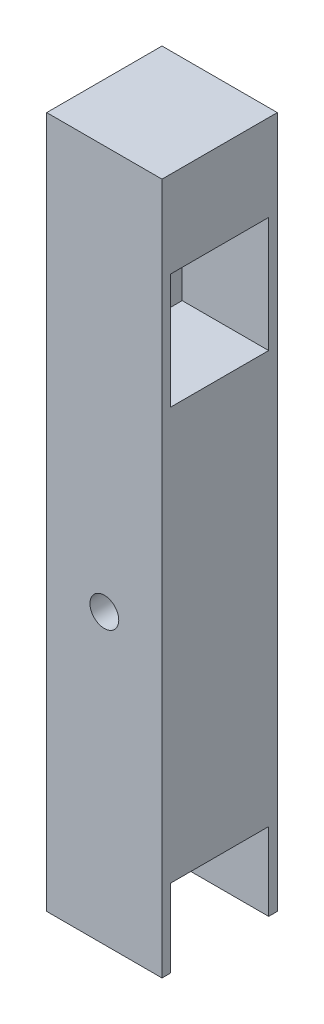
ISO-10303-21;
HEADER;
FILE_DESCRIPTION(('STEP AP214'),'2;1');
FILE_NAME('part.step','',(''),(''),'','','');
FILE_SCHEMA(('AUTOMOTIVE_DESIGN { 1 0 10303 214 1 1 1 1 }'));
ENDSEC;
DATA;
#1=APPLICATION_CONTEXT('core data for automotive mechanical design processes');
#2=APPLICATION_PROTOCOL_DEFINITION('international standard','automotive_design',2000,#1);
#3=PRODUCT_CONTEXT('',#1,'mechanical');
#4=PRODUCT('Part','Part','',(#3));
#5=PRODUCT_RELATED_PRODUCT_CATEGORY('part','',(#4));
#6=PRODUCT_DEFINITION_FORMATION('','',#4);
#7=PRODUCT_DEFINITION_CONTEXT('part definition',#1,'design');
#8=PRODUCT_DEFINITION('design','',#6,#7);
#9=PRODUCT_DEFINITION_SHAPE('','',#8);
#10=(LENGTH_UNIT() NAMED_UNIT(*) SI_UNIT(.MILLI.,.METRE.));
#11=(NAMED_UNIT(*) PLANE_ANGLE_UNIT() SI_UNIT($,.RADIAN.));
#12=(NAMED_UNIT(*) SI_UNIT($,.STERADIAN.) SOLID_ANGLE_UNIT());
#13=UNCERTAINTY_MEASURE_WITH_UNIT(LENGTH_MEASURE(1.E-05),#10,'distance_accuracy_value','');
#14=(GEOMETRIC_REPRESENTATION_CONTEXT(3) GLOBAL_UNCERTAINTY_ASSIGNED_CONTEXT((#13)) GLOBAL_UNIT_ASSIGNED_CONTEXT((#10,
#11,#12)) REPRESENTATION_CONTEXT('',''));
#15=CARTESIAN_POINT('',(0.,0.,0.));
#16=DIRECTION('',(0.,0.,1.));
#17=DIRECTION('',(1.,0.,0.));
#18=AXIS2_PLACEMENT_3D('',#15,#16,#17);
#19=CARTESIAN_POINT('',(25.4,0.,25.4));
#20=DIRECTION('',(-1.,0.,0.));
#21=DIRECTION('',(0.,-1.,0.));
#22=AXIS2_PLACEMENT_3D('',#19,#20,#21);
#23=PLANE('',#22);
#24=DIRECTION('',(0.,0.,-1.));
#25=VECTOR('',#24,1.);
#26=CARTESIAN_POINT('',(25.4,17.14754,23.495));
#27=LINE('',#26,#25);
#28=CARTESIAN_POINT('',(25.4,17.14754,23.495));
#29=VERTEX_POINT('',#28);
#30=CARTESIAN_POINT('',(25.4,17.14754,1.90499999999998));
#31=VERTEX_POINT('',#30);
#32=EDGE_CURVE('E60',#29,#31,#27,.T.);
#33=ORIENTED_EDGE('',*,*,#32,.T.);
#34=DIRECTION('',(0.,1.,0.));
#35=VECTOR('',#34,1.);
#36=CARTESIAN_POINT('',(25.4,-4.44245999999999,1.90499999999998));
#37=LINE('',#36,#35);
#38=CARTESIAN_POINT('',(25.4,0.,1.90499999999998));
#39=VERTEX_POINT('',#38);
#40=EDGE_CURVE('E175',#39,#31,#37,.T.);
#41=ORIENTED_EDGE('',*,*,#40,.F.);
#42=DIRECTION('',(0.,0.,-1.));
#43=VECTOR('',#42,1.);
#44=CARTESIAN_POINT('',(25.4,0.,25.4));
#45=LINE('',#44,#43);
#46=CARTESIAN_POINT('',(25.4,0.,0.));
#47=VERTEX_POINT('',#46);
#48=EDGE_CURVE('E229',#39,#47,#45,.T.);
#49=ORIENTED_EDGE('',*,*,#48,.T.);
#50=DIRECTION('',(0.,1.,0.));
#51=VECTOR('',#50,1.);
#52=CARTESIAN_POINT('',(25.4,0.,0.));
#53=LINE('',#52,#51);
#54=CARTESIAN_POINT('',(25.4,152.4,0.));
#55=VERTEX_POINT('',#54);
#56=EDGE_CURVE('E218',#47,#55,#53,.T.);
#57=ORIENTED_EDGE('',*,*,#56,.T.);
#58=DIRECTION('',(0.,0.,-1.));
#59=VECTOR('',#58,1.);
#60=CARTESIAN_POINT('',(25.4,152.4,25.4));
#61=LINE('',#60,#59);
#62=CARTESIAN_POINT('',(25.4,152.4,25.4));
#63=VERTEX_POINT('',#62);
#64=EDGE_CURVE('E227',#63,#55,#61,.T.);
#65=ORIENTED_EDGE('',*,*,#64,.F.);
#66=DIRECTION('',(0.,1.,0.));
#67=VECTOR('',#66,1.);
#68=CARTESIAN_POINT('',(25.4,0.,25.4));
#69=LINE('',#68,#67);
#70=CARTESIAN_POINT('',(25.4,0.,25.4));
#71=VERTEX_POINT('',#70);
#72=EDGE_CURVE('E204',#71,#63,#69,.T.);
#73=ORIENTED_EDGE('',*,*,#72,.F.);
#74=CARTESIAN_POINT('',(25.4,0.,23.495));
#75=VERTEX_POINT('',#74);
#76=EDGE_CURVE('E44',#71,#75,#45,.T.);
#77=ORIENTED_EDGE('',*,*,#76,.T.);
#78=DIRECTION('',(0.,1.,0.));
#79=VECTOR('',#78,1.);
#80=CARTESIAN_POINT('',(25.4,-4.44245999999999,23.495));
#81=LINE('',#80,#79);
#82=EDGE_CURVE('E172',#75,#29,#81,.T.);
#83=ORIENTED_EDGE('',*,*,#82,.T.);
#84=EDGE_LOOP('',(#33,#41,#49,#57,#65,#73,#77,#83));
#85=FACE_BOUND('',#84,.T.);
#86=DIRECTION('',(0.,0.,-1.));
#87=VECTOR('',#86,1.);
#88=CARTESIAN_POINT('',(25.4,133.35254,23.495));
#89=LINE('',#88,#87);
#90=CARTESIAN_POINT('',(25.4,133.35254,23.495));
#91=VERTEX_POINT('',#90);
#92=CARTESIAN_POINT('',(25.4,133.35254,1.90499999999999));
#93=VERTEX_POINT('',#92);
#94=EDGE_CURVE('E52',#91,#93,#89,.T.);
#95=ORIENTED_EDGE('',*,*,#94,.T.);
#96=DIRECTION('',(0.,1.,0.));
#97=VECTOR('',#96,1.);
#98=CARTESIAN_POINT('',(25.4,107.95254,1.90499999999999));
#99=LINE('',#98,#97);
#100=CARTESIAN_POINT('',(25.4,107.95254,1.90499999999999));
#101=VERTEX_POINT('',#100);
#102=EDGE_CURVE('E143',#101,#93,#99,.T.);
#103=ORIENTED_EDGE('',*,*,#102,.F.);
#104=DIRECTION('',(0.,0.,-1.));
#105=VECTOR('',#104,1.);
#106=CARTESIAN_POINT('',(25.4,107.95254,23.495));
#107=LINE('',#106,#105);
#108=CARTESIAN_POINT('',(25.4,107.95254,23.495));
#109=VERTEX_POINT('',#108);
#110=EDGE_CURVE('E158',#109,#101,#107,.T.);
#111=ORIENTED_EDGE('',*,*,#110,.F.);
#112=DIRECTION('',(0.,1.,0.));
#113=VECTOR('',#112,1.);
#114=CARTESIAN_POINT('',(25.4,107.95254,23.495));
#115=LINE('',#114,#113);
#116=EDGE_CURVE('E136',#109,#91,#115,.T.);
#117=ORIENTED_EDGE('',*,*,#116,.T.);
#118=EDGE_LOOP('',(#95,#103,#111,#117));
#119=FACE_BOUND('',#118,.T.);
#120=ADVANCED_FACE('F35',(#85,#119),#23,.F.);
#121=CARTESIAN_POINT('',(0.,6.35254,12.7));
#122=DIRECTION('',(1.,0.,0.));
#123=DIRECTION('',(0.,1.,0.));
#124=AXIS2_PLACEMENT_3D('',#121,#122,#123);
#125=CYLINDRICAL_SURFACE('',#124,6.34999999999999);
#126=CARTESIAN_POINT('',(0.,6.35254,12.7));
#127=DIRECTION('',(1.,0.,0.));
#128=DIRECTION('',(0.,1.,0.));
#129=AXIS2_PLACEMENT_3D('',#126,#127,#128);
#130=CIRCLE('',#129,6.34999999999999);
#131=CARTESIAN_POINT('',(0.,12.70254,12.7));
#132=VERTEX_POINT('',#131);
#133=EDGE_CURVE('E191',#132,#132,#130,.T.);
#134=ORIENTED_EDGE('',*,*,#133,.F.);
#135=EDGE_LOOP('',(#134));
#136=FACE_BOUND('',#135,.T.);
#137=CARTESIAN_POINT('',(6.35,6.35254,12.7));
#138=DIRECTION('',(1.,0.,0.));
#139=DIRECTION('',(0.,1.,0.));
#140=AXIS2_PLACEMENT_3D('',#137,#138,#139);
#141=CIRCLE('',#140,6.34999999999999);
#142=CARTESIAN_POINT('',(6.35,12.70254,12.7));
#143=VERTEX_POINT('',#142);
#144=EDGE_CURVE('E39',#143,#143,#141,.F.);
#145=ORIENTED_EDGE('',*,*,#144,.F.);
#146=EDGE_LOOP('',(#145));
#147=FACE_BOUND('',#146,.T.);
#148=ADVANCED_FACE('F239',(#136,#147),#125,.F.);
#149=CARTESIAN_POINT('',(0.,120.65254,12.7));
#150=DIRECTION('',(1.,0.,0.));
#151=DIRECTION('',(0.,1.,0.));
#152=AXIS2_PLACEMENT_3D('',#149,#150,#151);
#153=CYLINDRICAL_SURFACE('',#152,6.34999999999999);
#154=CARTESIAN_POINT('',(0.,120.65254,12.7));
#155=DIRECTION('',(1.,0.,0.));
#156=DIRECTION('',(0.,1.,0.));
#157=AXIS2_PLACEMENT_3D('',#154,#155,#156);
#158=CIRCLE('',#157,6.34999999999999);
#159=CARTESIAN_POINT('',(0.,127.00254,12.7));
#160=VERTEX_POINT('',#159);
#161=EDGE_CURVE('E192',#160,#160,#158,.T.);
#162=ORIENTED_EDGE('',*,*,#161,.F.);
#163=EDGE_LOOP('',(#162));
#164=FACE_BOUND('',#163,.T.);
#165=CARTESIAN_POINT('',(6.34999999999998,120.65254,12.7));
#166=DIRECTION('',(1.,0.,0.));
#167=DIRECTION('',(0.,1.,0.));
#168=AXIS2_PLACEMENT_3D('',#165,#166,#167);
#169=CIRCLE('',#168,6.34999999999999);
#170=CARTESIAN_POINT('',(6.34999999999998,127.00254,12.7));
#171=VERTEX_POINT('',#170);
#172=EDGE_CURVE('E144',#171,#171,#169,.F.);
#173=ORIENTED_EDGE('',*,*,#172,.F.);
#174=EDGE_LOOP('',(#173));
#175=FACE_BOUND('',#174,.T.);
#176=ADVANCED_FACE('F241',(#164,#175),#153,.F.);
#177=CARTESIAN_POINT('',(0.,0.,25.4));
#178=DIRECTION('',(-1.,0.,0.));
#179=DIRECTION('',(0.,0.,1.));
#180=AXIS2_PLACEMENT_3D('',#177,#178,#179);
#181=PLANE('',#180);
#182=ORIENTED_EDGE('',*,*,#161,.T.);
#183=EDGE_LOOP('',(#182));
#184=FACE_BOUND('',#183,.T.);
#185=ORIENTED_EDGE('',*,*,#133,.T.);
#186=EDGE_LOOP('',(#185));
#187=FACE_BOUND('',#186,.T.);
#188=DIRECTION('',(0.,1.,0.));
#189=VECTOR('',#188,1.);
#190=CARTESIAN_POINT('',(0.,0.,0.));
#191=LINE('',#190,#189);
#192=CARTESIAN_POINT('',(0.,0.,0.));
#193=VERTEX_POINT('',#192);
#194=CARTESIAN_POINT('',(0.,152.4,0.));
#195=VERTEX_POINT('',#194);
#196=EDGE_CURVE('E195',#193,#195,#191,.T.);
#197=ORIENTED_EDGE('',*,*,#196,.F.);
#198=DIRECTION('',(0.,0.,-1.));
#199=VECTOR('',#198,1.);
#200=CARTESIAN_POINT('',(0.,0.,25.4));
#201=LINE('',#200,#199);
#202=CARTESIAN_POINT('',(0.,0.,25.4));
#203=VERTEX_POINT('',#202);
#204=EDGE_CURVE('E11',#203,#193,#201,.T.);
#205=ORIENTED_EDGE('',*,*,#204,.F.);
#206=DIRECTION('',(0.,1.,0.));
#207=VECTOR('',#206,1.);
#208=CARTESIAN_POINT('',(0.,0.,25.4));
#209=LINE('',#208,#207);
#210=CARTESIAN_POINT('',(0.,152.4,25.4));
#211=VERTEX_POINT('',#210);
#212=EDGE_CURVE('E198',#203,#211,#209,.T.);
#213=ORIENTED_EDGE('',*,*,#212,.T.);
#214=DIRECTION('',(0.,0.,-1.));
#215=VECTOR('',#214,1.);
#216=CARTESIAN_POINT('',(0.,152.4,25.4));
#217=LINE('',#216,#215);
#218=EDGE_CURVE('E212',#211,#195,#217,.T.);
#219=ORIENTED_EDGE('',*,*,#218,.T.);
#220=EDGE_LOOP('',(#197,#205,#213,#219));
#221=FACE_BOUND('',#220,.T.);
#222=ADVANCED_FACE('F37',(#184,#187,#221),#181,.T.);
#223=CARTESIAN_POINT('',(0.,0.,25.4));
#224=DIRECTION('',(0.,1.,0.));
#225=DIRECTION('',(0.,0.,1.));
#226=AXIS2_PLACEMENT_3D('',#223,#224,#225);
#227=PLANE('',#226);
#228=ORIENTED_EDGE('',*,*,#48,.F.);
#229=DIRECTION('',(-1.,0.,0.));
#230=VECTOR('',#229,1.);
#231=CARTESIAN_POINT('',(0.,0.,1.90499999999998));
#232=LINE('',#231,#230);
#233=CARTESIAN_POINT('',(6.35,0.,1.90499999999998));
#234=VERTEX_POINT('',#233);
#235=EDGE_CURVE('E188',#39,#234,#232,.T.);
#236=ORIENTED_EDGE('',*,*,#235,.T.);
#237=DIRECTION('',(0.,0.,-1.));
#238=VECTOR('',#237,1.);
#239=CARTESIAN_POINT('',(6.35,0.,25.4));
#240=LINE('',#239,#238);
#241=CARTESIAN_POINT('',(6.35,0.,23.495));
#242=VERTEX_POINT('',#241);
#243=EDGE_CURVE('E184',#242,#234,#240,.T.);
#244=ORIENTED_EDGE('',*,*,#243,.F.);
#245=DIRECTION('',(-1.,0.,0.));
#246=VECTOR('',#245,1.);
#247=CARTESIAN_POINT('',(0.,0.,23.495));
#248=LINE('',#247,#246);
#249=EDGE_CURVE('E186',#75,#242,#248,.T.);
#250=ORIENTED_EDGE('',*,*,#249,.F.);
#251=ORIENTED_EDGE('',*,*,#76,.F.);
#252=DIRECTION('',(1.,0.,0.));
#253=VECTOR('',#252,1.);
#254=CARTESIAN_POINT('',(0.,0.,25.4));
#255=LINE('',#254,#253);
#256=EDGE_CURVE('E201',#203,#71,#255,.T.);
#257=ORIENTED_EDGE('',*,*,#256,.F.);
#258=ORIENTED_EDGE('',*,*,#204,.T.);
#259=DIRECTION('',(1.,0.,0.));
#260=VECTOR('',#259,1.);
#261=CARTESIAN_POINT('',(0.,0.,0.));
#262=LINE('',#261,#260);
#263=EDGE_CURVE('E215',#193,#47,#262,.T.);
#264=ORIENTED_EDGE('',*,*,#263,.T.);
#265=EDGE_LOOP('',(#228,#236,#244,#250,#251,#257,#258,#264));
#266=FACE_BOUND('',#265,.T.);
#267=ADVANCED_FACE('F269',(#266),#227,.F.);
#268=CARTESIAN_POINT('',(0.,152.4,25.4));
#269=DIRECTION('',(0.,1.,0.));
#270=DIRECTION('',(0.,0.,1.));
#271=AXIS2_PLACEMENT_3D('',#268,#269,#270);
#272=PLANE('',#271);
#273=DIRECTION('',(1.,0.,0.));
#274=VECTOR('',#273,1.);
#275=CARTESIAN_POINT('',(0.,152.4,0.));
#276=LINE('',#275,#274);
#277=EDGE_CURVE('E221',#195,#55,#276,.T.);
#278=ORIENTED_EDGE('',*,*,#277,.F.);
#279=ORIENTED_EDGE('',*,*,#218,.F.);
#280=DIRECTION('',(1.,0.,0.));
#281=VECTOR('',#280,1.);
#282=CARTESIAN_POINT('',(0.,152.4,25.4));
#283=LINE('',#282,#281);
#284=EDGE_CURVE('E206',#211,#63,#283,.T.);
#285=ORIENTED_EDGE('',*,*,#284,.T.);
#286=ORIENTED_EDGE('',*,*,#64,.T.);
#287=EDGE_LOOP('',(#278,#279,#285,#286));
#288=FACE_BOUND('',#287,.T.);
#289=ADVANCED_FACE('F266',(#288),#272,.T.);
#290=CARTESIAN_POINT('',(12.7,63.5,25.4));
#291=DIRECTION('',(0.,0.,-1.));
#292=DIRECTION('',(-1.,0.,0.));
#293=AXIS2_PLACEMENT_3D('',#290,#291,#292);
#294=CYLINDRICAL_SURFACE('',#293,3.175);
#295=CARTESIAN_POINT('',(12.7,63.5,25.4));
#296=DIRECTION('',(0.,0.,1.));
#297=DIRECTION('',(1.,0.,0.));
#298=AXIS2_PLACEMENT_3D('',#295,#296,#297);
#299=CIRCLE('',#298,3.175);
#300=CARTESIAN_POINT('',(15.875,63.5,25.4));
#301=VERTEX_POINT('',#300);
#302=EDGE_CURVE('E209',#301,#301,#299,.T.);
#303=ORIENTED_EDGE('',*,*,#302,.T.);
#304=EDGE_LOOP('',(#303));
#305=FACE_BOUND('',#304,.T.);
#306=CARTESIAN_POINT('',(12.7,63.5,0.));
#307=DIRECTION('',(0.,0.,1.));
#308=DIRECTION('',(1.,0.,0.));
#309=AXIS2_PLACEMENT_3D('',#306,#307,#308);
#310=CIRCLE('',#309,3.175);
#311=CARTESIAN_POINT('',(15.875,63.5,0.));
#312=VERTEX_POINT('',#311);
#313=EDGE_CURVE('E202',#312,#312,#310,.T.);
#314=ORIENTED_EDGE('',*,*,#313,.F.);
#315=EDGE_LOOP('',(#314));
#316=FACE_BOUND('',#315,.T.);
#317=ADVANCED_FACE('F259',(#305,#316),#294,.F.);
#318=CARTESIAN_POINT('',(0.,0.,25.4));
#319=DIRECTION('',(0.,0.,1.));
#320=DIRECTION('',(1.,0.,0.));
#321=AXIS2_PLACEMENT_3D('',#318,#319,#320);
#322=PLANE('',#321);
#323=ORIENTED_EDGE('',*,*,#212,.F.);
#324=ORIENTED_EDGE('',*,*,#256,.T.);
#325=ORIENTED_EDGE('',*,*,#72,.T.);
#326=ORIENTED_EDGE('',*,*,#284,.F.);
#327=EDGE_LOOP('',(#323,#324,#325,#326));
#328=FACE_BOUND('',#327,.T.);
#329=ORIENTED_EDGE('',*,*,#302,.F.);
#330=EDGE_LOOP('',(#329));
#331=FACE_BOUND('',#330,.T.);
#332=ADVANCED_FACE('F255',(#328,#331),#322,.T.);
#333=CARTESIAN_POINT('',(0.,0.,0.));
#334=DIRECTION('',(0.,0.,1.));
#335=DIRECTION('',(1.,0.,0.));
#336=AXIS2_PLACEMENT_3D('',#333,#334,#335);
#337=PLANE('',#336);
#338=ORIENTED_EDGE('',*,*,#196,.T.);
#339=ORIENTED_EDGE('',*,*,#277,.T.);
#340=ORIENTED_EDGE('',*,*,#56,.F.);
#341=ORIENTED_EDGE('',*,*,#263,.F.);
#342=EDGE_LOOP('',(#338,#339,#340,#341));
#343=FACE_BOUND('',#342,.T.);
#344=ORIENTED_EDGE('',*,*,#313,.T.);
#345=EDGE_LOOP('',(#344));
#346=FACE_BOUND('',#345,.T.);
#347=ADVANCED_FACE('F258',(#343,#346),#337,.F.);
#348=CARTESIAN_POINT('',(6.34999999999999,0.,0.));
#349=DIRECTION('',(1.,0.,0.));
#350=DIRECTION('',(0.,1.,0.));
#351=AXIS2_PLACEMENT_3D('',#348,#349,#350);
#352=PLANE('',#351);
#353=DIRECTION('',(0.,0.,-1.));
#354=VECTOR('',#353,1.);
#355=CARTESIAN_POINT('',(6.34999999999998,133.35254,23.495));
#356=LINE('',#355,#354);
#357=CARTESIAN_POINT('',(6.34999999999998,133.35254,23.495));
#358=VERTEX_POINT('',#357);
#359=CARTESIAN_POINT('',(6.34999999999998,133.35254,1.90499999999999));
#360=VERTEX_POINT('',#359);
#361=EDGE_CURVE('E126',#358,#360,#356,.T.);
#362=ORIENTED_EDGE('',*,*,#361,.F.);
#363=DIRECTION('',(0.,1.,0.));
#364=VECTOR('',#363,1.);
#365=CARTESIAN_POINT('',(6.34999999999998,107.95254,23.495));
#366=LINE('',#365,#364);
#367=CARTESIAN_POINT('',(6.34999999999998,107.95254,23.495));
#368=VERTEX_POINT('',#367);
#369=EDGE_CURVE('E152',#368,#358,#366,.T.);
#370=ORIENTED_EDGE('',*,*,#369,.F.);
#371=DIRECTION('',(0.,0.,-1.));
#372=VECTOR('',#371,1.);
#373=CARTESIAN_POINT('',(6.34999999999998,107.95254,23.495));
#374=LINE('',#373,#372);
#375=CARTESIAN_POINT('',(6.34999999999998,107.95254,1.90499999999999));
#376=VERTEX_POINT('',#375);
#377=EDGE_CURVE('E150',#368,#376,#374,.T.);
#378=ORIENTED_EDGE('',*,*,#377,.T.);
#379=DIRECTION('',(0.,1.,0.));
#380=VECTOR('',#379,1.);
#381=CARTESIAN_POINT('',(6.34999999999998,107.95254,1.90499999999999));
#382=LINE('',#381,#380);
#383=EDGE_CURVE('E135',#376,#360,#382,.T.);
#384=ORIENTED_EDGE('',*,*,#383,.T.);
#385=EDGE_LOOP('',(#362,#370,#378,#384));
#386=FACE_BOUND('',#385,.T.);
#387=ORIENTED_EDGE('',*,*,#172,.T.);
#388=EDGE_LOOP('',(#387));
#389=FACE_BOUND('',#388,.T.);
#390=ADVANCED_FACE('F147',(#386,#389),#352,.T.);
#391=CARTESIAN_POINT('',(6.34999999999998,133.35254,23.495));
#392=DIRECTION('',(0.,-1.,0.));
#393=DIRECTION('',(1.,0.,0.));
#394=AXIS2_PLACEMENT_3D('',#391,#392,#393);
#395=PLANE('',#394);
#396=ORIENTED_EDGE('',*,*,#94,.F.);
#397=DIRECTION('',(1.,0.,0.));
#398=VECTOR('',#397,1.);
#399=CARTESIAN_POINT('',(6.34999999999998,133.35254,23.495));
#400=LINE('',#399,#398);
#401=EDGE_CURVE('E131',#358,#91,#400,.T.);
#402=ORIENTED_EDGE('',*,*,#401,.F.);
#403=ORIENTED_EDGE('',*,*,#361,.T.);
#404=DIRECTION('',(1.,0.,0.));
#405=VECTOR('',#404,1.);
#406=CARTESIAN_POINT('',(6.34999999999998,133.35254,1.90499999999999));
#407=LINE('',#406,#405);
#408=EDGE_CURVE('E129',#360,#93,#407,.T.);
#409=ORIENTED_EDGE('',*,*,#408,.T.);
#410=EDGE_LOOP('',(#396,#402,#403,#409));
#411=FACE_BOUND('',#410,.T.);
#412=ADVANCED_FACE('F128',(#411),#395,.T.);
#413=CARTESIAN_POINT('',(6.34999999999998,107.95254,1.90499999999999));
#414=DIRECTION('',(0.,0.,-1.));
#415=DIRECTION('',(-1.,0.,0.));
#416=AXIS2_PLACEMENT_3D('',#413,#414,#415);
#417=PLANE('',#416);
#418=ORIENTED_EDGE('',*,*,#102,.T.);
#419=ORIENTED_EDGE('',*,*,#408,.F.);
#420=ORIENTED_EDGE('',*,*,#383,.F.);
#421=DIRECTION('',(1.,0.,0.));
#422=VECTOR('',#421,1.);
#423=CARTESIAN_POINT('',(6.34999999999998,107.95254,1.90499999999999));
#424=LINE('',#423,#422);
#425=EDGE_CURVE('E145',#376,#101,#424,.T.);
#426=ORIENTED_EDGE('',*,*,#425,.T.);
#427=EDGE_LOOP('',(#418,#419,#420,#426));
#428=FACE_BOUND('',#427,.T.);
#429=ADVANCED_FACE('F140',(#428),#417,.F.);
#430=CARTESIAN_POINT('',(6.34999999999998,107.95254,23.495));
#431=DIRECTION('',(0.,-1.,0.));
#432=DIRECTION('',(1.,0.,0.));
#433=AXIS2_PLACEMENT_3D('',#430,#431,#432);
#434=PLANE('',#433);
#435=ORIENTED_EDGE('',*,*,#110,.T.);
#436=ORIENTED_EDGE('',*,*,#425,.F.);
#437=ORIENTED_EDGE('',*,*,#377,.F.);
#438=DIRECTION('',(1.,0.,0.));
#439=VECTOR('',#438,1.);
#440=CARTESIAN_POINT('',(6.34999999999998,107.95254,23.495));
#441=LINE('',#440,#439);
#442=EDGE_CURVE('E164',#368,#109,#441,.T.);
#443=ORIENTED_EDGE('',*,*,#442,.T.);
#444=EDGE_LOOP('',(#435,#436,#437,#443));
#445=FACE_BOUND('',#444,.T.);
#446=ADVANCED_FACE('F322',(#445),#434,.F.);
#447=CARTESIAN_POINT('',(6.34999999999998,107.95254,23.495));
#448=DIRECTION('',(0.,0.,-1.));
#449=DIRECTION('',(-1.,0.,0.));
#450=AXIS2_PLACEMENT_3D('',#447,#448,#449);
#451=PLANE('',#450);
#452=ORIENTED_EDGE('',*,*,#116,.F.);
#453=ORIENTED_EDGE('',*,*,#442,.F.);
#454=ORIENTED_EDGE('',*,*,#369,.T.);
#455=ORIENTED_EDGE('',*,*,#401,.T.);
#456=EDGE_LOOP('',(#452,#453,#454,#455));
#457=FACE_BOUND('',#456,.T.);
#458=ADVANCED_FACE('F313',(#457),#451,.T.);
#459=CARTESIAN_POINT('',(6.35,-4.44245999999999,1.90499999999998));
#460=DIRECTION('',(0.,0.,-1.));
#461=DIRECTION('',(-1.,0.,0.));
#462=AXIS2_PLACEMENT_3D('',#459,#460,#461);
#463=PLANE('',#462);
#464=ORIENTED_EDGE('',*,*,#40,.T.);
#465=DIRECTION('',(1.,0.,0.));
#466=VECTOR('',#465,1.);
#467=CARTESIAN_POINT('',(6.34999999999999,17.14754,1.90499999999998));
#468=LINE('',#467,#466);
#469=CARTESIAN_POINT('',(6.34999999999999,17.14754,1.90499999999998));
#470=VERTEX_POINT('',#469);
#471=EDGE_CURVE('E167',#470,#31,#468,.T.);
#472=ORIENTED_EDGE('',*,*,#471,.F.);
#473=DIRECTION('',(0.,1.,0.));
#474=VECTOR('',#473,1.);
#475=CARTESIAN_POINT('',(6.35,-4.44245999999999,1.90499999999998));
#476=LINE('',#475,#474);
#477=EDGE_CURVE('E180',#234,#470,#476,.T.);
#478=ORIENTED_EDGE('',*,*,#477,.F.);
#479=ORIENTED_EDGE('',*,*,#235,.F.);
#480=EDGE_LOOP('',(#464,#472,#478,#479));
#481=FACE_BOUND('',#480,.T.);
#482=ADVANCED_FACE('F286',(#481),#463,.F.);
#483=CARTESIAN_POINT('',(6.35,-4.44245999999999,23.495));
#484=DIRECTION('',(0.,0.,-1.));
#485=DIRECTION('',(-1.,0.,0.));
#486=AXIS2_PLACEMENT_3D('',#483,#484,#485);
#487=PLANE('',#486);
#488=ORIENTED_EDGE('',*,*,#249,.T.);
#489=DIRECTION('',(0.,1.,0.));
#490=VECTOR('',#489,1.);
#491=CARTESIAN_POINT('',(6.35,-4.44245999999999,23.495));
#492=LINE('',#491,#490);
#493=CARTESIAN_POINT('',(6.34999999999999,17.14754,23.495));
#494=VERTEX_POINT('',#493);
#495=EDGE_CURVE('E171',#242,#494,#492,.T.);
#496=ORIENTED_EDGE('',*,*,#495,.T.);
#497=DIRECTION('',(1.,0.,0.));
#498=VECTOR('',#497,1.);
#499=CARTESIAN_POINT('',(6.34999999999999,17.14754,23.495));
#500=LINE('',#499,#498);
#501=EDGE_CURVE('E169',#494,#29,#500,.T.);
#502=ORIENTED_EDGE('',*,*,#501,.T.);
#503=ORIENTED_EDGE('',*,*,#82,.F.);
#504=EDGE_LOOP('',(#488,#496,#502,#503));
#505=FACE_BOUND('',#504,.T.);
#506=ADVANCED_FACE('F306',(#505),#487,.T.);
#507=CARTESIAN_POINT('',(6.35,0.,0.));
#508=DIRECTION('',(1.,0.,0.));
#509=DIRECTION('',(0.,1.,0.));
#510=AXIS2_PLACEMENT_3D('',#507,#508,#509);
#511=PLANE('',#510);
#512=ORIENTED_EDGE('',*,*,#144,.T.);
#513=EDGE_LOOP('',(#512));
#514=FACE_BOUND('',#513,.T.);
#515=ORIENTED_EDGE('',*,*,#243,.T.);
#516=ORIENTED_EDGE('',*,*,#477,.T.);
#517=DIRECTION('',(0.,0.,-1.));
#518=VECTOR('',#517,1.);
#519=CARTESIAN_POINT('',(6.34999999999999,17.14754,23.495));
#520=LINE('',#519,#518);
#521=EDGE_CURVE('E176',#494,#470,#520,.T.);
#522=ORIENTED_EDGE('',*,*,#521,.F.);
#523=ORIENTED_EDGE('',*,*,#495,.F.);
#524=EDGE_LOOP('',(#515,#516,#522,#523));
#525=FACE_BOUND('',#524,.T.);
#526=ADVANCED_FACE('F236',(#514,#525),#511,.T.);
#527=CARTESIAN_POINT('',(6.34999999999999,17.14754,23.495));
#528=DIRECTION('',(0.,-1.,0.));
#529=DIRECTION('',(1.,0.,0.));
#530=AXIS2_PLACEMENT_3D('',#527,#528,#529);
#531=PLANE('',#530);
#532=ORIENTED_EDGE('',*,*,#32,.F.);
#533=ORIENTED_EDGE('',*,*,#501,.F.);
#534=ORIENTED_EDGE('',*,*,#521,.T.);
#535=ORIENTED_EDGE('',*,*,#471,.T.);
#536=EDGE_LOOP('',(#532,#533,#534,#535));
#537=FACE_BOUND('',#536,.T.);
#538=ADVANCED_FACE('F288',(#537),#531,.T.);
#539=CLOSED_SHELL('',(#120,#148,#176,#222,#267,#289,#317,#332,#347,#390,#412,#429,#446,#458,
#482,#506,#526,#538));
#540=MANIFOLD_SOLID_BREP('B2',#539);
#541=ADVANCED_BREP_SHAPE_REPRESENTATION('',(#18,#540),#14);
#542=SHAPE_DEFINITION_REPRESENTATION(#9,#541);
ENDSEC;
END-ISO-10303-21;
